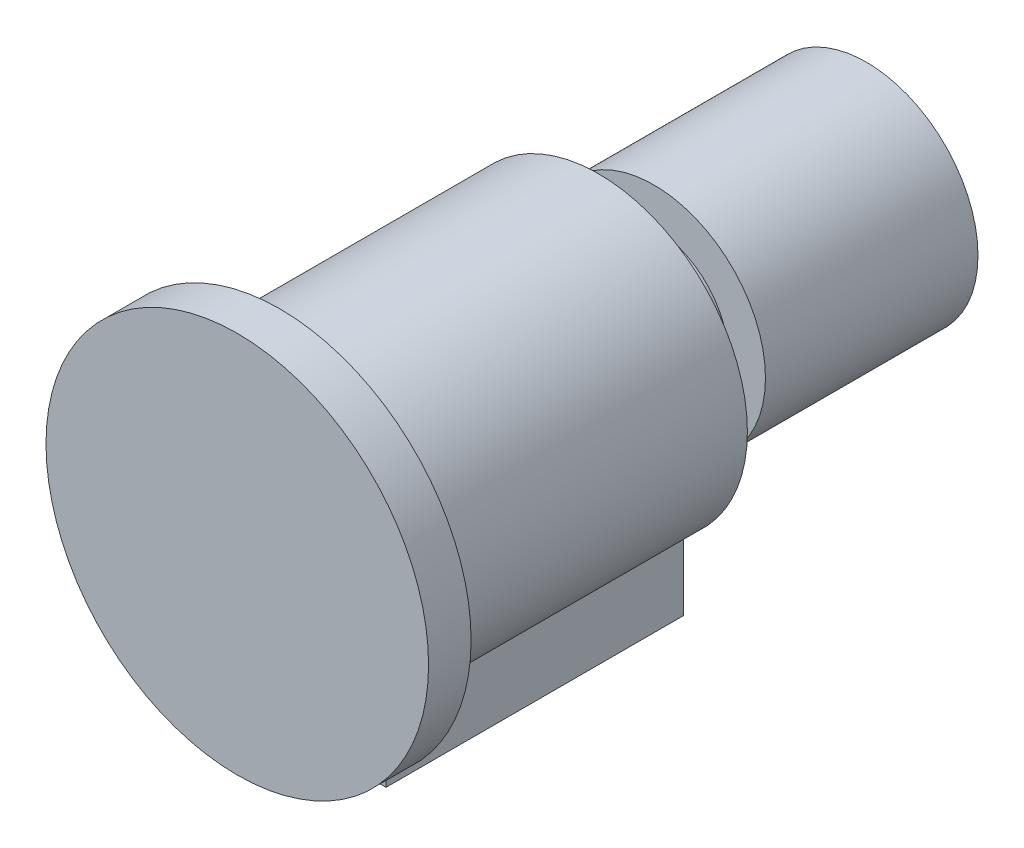
ISO-10303-21;
HEADER;
FILE_DESCRIPTION(('STEP AP214'),'2;1');
FILE_NAME('part.step','',(''),(''),'','','');
FILE_SCHEMA(('AUTOMOTIVE_DESIGN { 1 0 10303 214 1 1 1 1 }'));
ENDSEC;
DATA;
#1=APPLICATION_CONTEXT('core data for automotive mechanical design processes');
#2=APPLICATION_PROTOCOL_DEFINITION('international standard','automotive_design',2000,#1);
#3=PRODUCT_CONTEXT('',#1,'mechanical');
#4=PRODUCT('Part','Part','',(#3));
#5=PRODUCT_RELATED_PRODUCT_CATEGORY('part','',(#4));
#6=PRODUCT_DEFINITION_FORMATION('','',#4);
#7=PRODUCT_DEFINITION_CONTEXT('part definition',#1,'design');
#8=PRODUCT_DEFINITION('design','',#6,#7);
#9=PRODUCT_DEFINITION_SHAPE('','',#8);
#10=(LENGTH_UNIT() NAMED_UNIT(*) SI_UNIT(.MILLI.,.METRE.));
#11=(NAMED_UNIT(*) PLANE_ANGLE_UNIT() SI_UNIT($,.RADIAN.));
#12=(NAMED_UNIT(*) SI_UNIT($,.STERADIAN.) SOLID_ANGLE_UNIT());
#13=UNCERTAINTY_MEASURE_WITH_UNIT(LENGTH_MEASURE(1.E-05),#10,'distance_accuracy_value','');
#14=(GEOMETRIC_REPRESENTATION_CONTEXT(3) GLOBAL_UNCERTAINTY_ASSIGNED_CONTEXT((#13)) GLOBAL_UNIT_ASSIGNED_CONTEXT((#10,
#11,#12)) REPRESENTATION_CONTEXT('',''));
#15=CARTESIAN_POINT('',(0.,0.,0.));
#16=DIRECTION('',(0.,0.,1.));
#17=DIRECTION('',(1.,0.,0.));
#18=AXIS2_PLACEMENT_3D('',#15,#16,#17);
#19=CARTESIAN_POINT('',(0.,0.,-176.));
#20=DIRECTION('',(0.,0.,-1.));
#21=DIRECTION('',(-1.,0.,0.));
#22=AXIS2_PLACEMENT_3D('',#19,#20,#21);
#23=CYLINDRICAL_SURFACE('',#22,52.5);
#24=CARTESIAN_POINT('',(0.,0.,-176.));
#25=DIRECTION('',(0.,0.,1.));
#26=DIRECTION('',(1.,0.,0.));
#27=AXIS2_PLACEMENT_3D('',#24,#25,#26);
#28=CIRCLE('',#27,52.5);
#29=CARTESIAN_POINT('',(52.5,0.,-176.));
#30=VERTEX_POINT('',#29);
#31=EDGE_CURVE('E11',#30,#30,#28,.T.);
#32=ORIENTED_EDGE('',*,*,#31,.F.);
#33=EDGE_LOOP('',(#32));
#34=FACE_BOUND('',#33,.T.);
#35=CARTESIAN_POINT('',(0.,0.,-276.));
#36=DIRECTION('',(0.,0.,1.));
#37=DIRECTION('',(1.,0.,0.));
#38=AXIS2_PLACEMENT_3D('',#35,#36,#37);
#39=CIRCLE('',#38,52.5);
#40=CARTESIAN_POINT('',(52.5,0.,-276.));
#41=VERTEX_POINT('',#40);
#42=EDGE_CURVE('E47',#41,#41,#39,.T.);
#43=ORIENTED_EDGE('',*,*,#42,.T.);
#44=EDGE_LOOP('',(#43));
#45=FACE_BOUND('',#44,.T.);
#46=ADVANCED_FACE('F44',(#34,#45),#23,.T.);
#47=CARTESIAN_POINT('',(0.,0.,-176.));
#48=DIRECTION('',(0.,0.,1.));
#49=DIRECTION('',(1.,0.,0.));
#50=AXIS2_PLACEMENT_3D('',#47,#48,#49);
#51=PLANE('',#50);
#52=ORIENTED_EDGE('',*,*,#31,.T.);
#53=EDGE_LOOP('',(#52));
#54=FACE_BOUND('',#53,.T.);
#55=ADVANCED_FACE('F59',(#54),#51,.T.);
#56=CARTESIAN_POINT('',(0.,0.,-276.));
#57=DIRECTION('',(0.,0.,1.));
#58=DIRECTION('',(1.,0.,0.));
#59=AXIS2_PLACEMENT_3D('',#56,#57,#58);
#60=PLANE('',#59);
#61=ORIENTED_EDGE('',*,*,#42,.F.);
#62=EDGE_LOOP('',(#61));
#63=FACE_BOUND('',#62,.T.);
#64=ADVANCED_FACE('F57',(#63),#60,.F.);
#65=CLOSED_SHELL('',(#46,#55,#64));
#66=MANIFOLD_SOLID_BREP('B2',#65);
#67=CARTESIAN_POINT('',(0.,0.,-150.));
#68=DIRECTION('',(0.,0.,1.));
#69=DIRECTION('',(1.,0.,0.));
#70=AXIS2_PLACEMENT_3D('',#67,#68,#69);
#71=CYLINDRICAL_SURFACE('',#70,70.);
#72=CARTESIAN_POINT('',(0.,0.,-150.));
#73=DIRECTION('',(0.,0.,1.));
#74=DIRECTION('',(1.,0.,0.));
#75=AXIS2_PLACEMENT_3D('',#72,#73,#74);
#76=CIRCLE('',#75,70.);
#77=CARTESIAN_POINT('',(70.,0.,-150.));
#78=VERTEX_POINT('',#77);
#79=EDGE_CURVE('E155',#78,#78,#76,.T.);
#80=ORIENTED_EDGE('',*,*,#79,.T.);
#81=EDGE_LOOP('',(#80));
#82=FACE_BOUND('',#81,.T.);
#83=CARTESIAN_POINT('',(0.,0.,0.));
#84=DIRECTION('',(0.,0.,1.));
#85=DIRECTION('',(1.,0.,0.));
#86=AXIS2_PLACEMENT_3D('',#83,#84,#85);
#87=CIRCLE('',#86,70.);
#88=CARTESIAN_POINT('',(70.,0.,0.));
#89=VERTEX_POINT('',#88);
#90=EDGE_CURVE('E153',#89,#89,#87,.T.);
#91=ORIENTED_EDGE('',*,*,#90,.F.);
#92=EDGE_LOOP('',(#91));
#93=FACE_BOUND('',#92,.T.);
#94=CARTESIAN_POINT('',(0.,0.,-145.));
#95=DIRECTION('',(0.,0.,1.));
#96=DIRECTION('',(1.,0.,0.));
#97=AXIS2_PLACEMENT_3D('',#94,#95,#96);
#98=CIRCLE('',#97,70.);
#99=CARTESIAN_POINT('',(45.,-53.6190264738181,-145.));
#100=VERTEX_POINT('',#99);
#101=CARTESIAN_POINT('',(-45.,-53.6190264738181,-145.));
#102=VERTEX_POINT('',#101);
#103=EDGE_CURVE('E92',#100,#102,#98,.F.);
#104=ORIENTED_EDGE('',*,*,#103,.T.);
#105=DIRECTION('',(0.,0.,1.));
#106=VECTOR('',#105,1.);
#107=CARTESIAN_POINT('',(-45.,-53.6190264738181,-150.));
#108=LINE('',#107,#106);
#109=CARTESIAN_POINT('',(-45.,-53.6190264738181,-5.));
#110=VERTEX_POINT('',#109);
#111=EDGE_CURVE('E42',#102,#110,#108,.T.);
#112=ORIENTED_EDGE('',*,*,#111,.T.);
#113=CARTESIAN_POINT('',(0.,0.,-5.));
#114=DIRECTION('',(0.,0.,1.));
#115=DIRECTION('',(1.,0.,0.));
#116=AXIS2_PLACEMENT_3D('',#113,#114,#115);
#117=CIRCLE('',#116,70.);
#118=CARTESIAN_POINT('',(45.,-53.6190264738181,-5.));
#119=VERTEX_POINT('',#118);
#120=EDGE_CURVE('E164',#119,#110,#117,.F.);
#121=ORIENTED_EDGE('',*,*,#120,.F.);
#122=DIRECTION('',(0.,0.,1.));
#123=VECTOR('',#122,1.);
#124=CARTESIAN_POINT('',(45.,-53.6190264738181,-150.));
#125=LINE('',#124,#123);
#126=EDGE_CURVE('E102',#100,#119,#125,.T.);
#127=ORIENTED_EDGE('',*,*,#126,.F.);
#128=EDGE_LOOP('',(#104,#112,#121,#127));
#129=FACE_BOUND('',#128,.T.);
#130=ADVANCED_FACE('F84',(#82,#93,#129),#71,.T.);
#131=CARTESIAN_POINT('',(0.,0.,20.));
#132=DIRECTION('',(0.,0.,-1.));
#133=DIRECTION('',(-1.,0.,0.));
#134=AXIS2_PLACEMENT_3D('',#131,#132,#133);
#135=CYLINDRICAL_SURFACE('',#134,90.);
#136=CARTESIAN_POINT('',(0.,0.,20.));
#137=DIRECTION('',(0.,0.,1.));
#138=DIRECTION('',(1.,0.,0.));
#139=AXIS2_PLACEMENT_3D('',#136,#137,#138);
#140=CIRCLE('',#139,90.);
#141=CARTESIAN_POINT('',(90.,0.,20.));
#142=VERTEX_POINT('',#141);
#143=EDGE_CURVE('E161',#142,#142,#140,.T.);
#144=ORIENTED_EDGE('',*,*,#143,.F.);
#145=EDGE_LOOP('',(#144));
#146=FACE_BOUND('',#145,.T.);
#147=CARTESIAN_POINT('',(0.,0.,0.));
#148=DIRECTION('',(0.,0.,1.));
#149=DIRECTION('',(1.,0.,0.));
#150=AXIS2_PLACEMENT_3D('',#147,#148,#149);
#151=CIRCLE('',#150,90.);
#152=CARTESIAN_POINT('',(90.,0.,0.));
#153=VERTEX_POINT('',#152);
#154=EDGE_CURVE('E158',#153,#153,#151,.T.);
#155=ORIENTED_EDGE('',*,*,#154,.T.);
#156=EDGE_LOOP('',(#155));
#157=FACE_BOUND('',#156,.T.);
#158=ADVANCED_FACE('F86',(#146,#157),#135,.T.);
#159=CARTESIAN_POINT('',(0.,0.,20.));
#160=DIRECTION('',(0.,0.,1.));
#161=DIRECTION('',(1.,0.,0.));
#162=AXIS2_PLACEMENT_3D('',#159,#160,#161);
#163=PLANE('',#162);
#164=ORIENTED_EDGE('',*,*,#143,.T.);
#165=EDGE_LOOP('',(#164));
#166=FACE_BOUND('',#165,.T.);
#167=ADVANCED_FACE('F184',(#166),#163,.T.);
#168=CARTESIAN_POINT('',(0.,0.,0.));
#169=DIRECTION('',(0.,0.,1.));
#170=DIRECTION('',(1.,0.,0.));
#171=AXIS2_PLACEMENT_3D('',#168,#169,#170);
#172=PLANE('',#171);
#173=ORIENTED_EDGE('',*,*,#90,.T.);
#174=EDGE_LOOP('',(#173));
#175=FACE_BOUND('',#174,.T.);
#176=ORIENTED_EDGE('',*,*,#154,.F.);
#177=EDGE_LOOP('',(#176));
#178=FACE_BOUND('',#177,.T.);
#179=ADVANCED_FACE('F192',(#175,#178),#172,.F.);
#180=CARTESIAN_POINT('',(0.,0.,-150.));
#181=DIRECTION('',(0.,0.,1.));
#182=DIRECTION('',(1.,0.,0.));
#183=AXIS2_PLACEMENT_3D('',#180,#181,#182);
#184=PLANE('',#183);
#185=CARTESIAN_POINT('',(0.,0.,-150.));
#186=DIRECTION('',(0.,0.,1.));
#187=DIRECTION('',(1.,0.,0.));
#188=AXIS2_PLACEMENT_3D('',#185,#186,#187);
#189=CIRCLE('',#188,35.);
#190=CARTESIAN_POINT('',(35.,0.,-150.));
#191=VERTEX_POINT('',#190);
#192=EDGE_CURVE('E143',#191,#191,#189,.T.);
#193=ORIENTED_EDGE('',*,*,#192,.T.);
#194=EDGE_LOOP('',(#193));
#195=FACE_BOUND('',#194,.T.);
#196=ORIENTED_EDGE('',*,*,#79,.F.);
#197=EDGE_LOOP('',(#196));
#198=FACE_BOUND('',#197,.T.);
#199=ADVANCED_FACE('F189',(#195,#198),#184,.F.);
#200=CARTESIAN_POINT('',(0.,0.,-275.));
#201=DIRECTION('',(0.,0.,1.));
#202=DIRECTION('',(1.,0.,0.));
#203=AXIS2_PLACEMENT_3D('',#200,#201,#202);
#204=CYLINDRICAL_SURFACE('',#203,35.);
#205=CARTESIAN_POINT('',(0.,0.,-275.));
#206=DIRECTION('',(0.,0.,1.));
#207=DIRECTION('',(1.,0.,0.));
#208=AXIS2_PLACEMENT_3D('',#205,#206,#207);
#209=CIRCLE('',#208,35.);
#210=CARTESIAN_POINT('',(35.,0.,-275.));
#211=VERTEX_POINT('',#210);
#212=EDGE_CURVE('E146',#211,#211,#209,.T.);
#213=ORIENTED_EDGE('',*,*,#212,.T.);
#214=EDGE_LOOP('',(#213));
#215=FACE_BOUND('',#214,.T.);
#216=ORIENTED_EDGE('',*,*,#192,.F.);
#217=EDGE_LOOP('',(#216));
#218=FACE_BOUND('',#217,.T.);
#219=ADVANCED_FACE('F199',(#215,#218),#204,.T.);
#220=CARTESIAN_POINT('',(0.,0.,-275.));
#221=DIRECTION('',(0.,0.,1.));
#222=DIRECTION('',(1.,0.,0.));
#223=AXIS2_PLACEMENT_3D('',#220,#221,#222);
#224=PLANE('',#223);
#225=ORIENTED_EDGE('',*,*,#212,.F.);
#226=EDGE_LOOP('',(#225));
#227=FACE_BOUND('',#226,.T.);
#228=ADVANCED_FACE('F208',(#227),#224,.F.);
#229=CARTESIAN_POINT('',(-45.,-85.,-5.));
#230=DIRECTION('',(1.,0.,0.));
#231=DIRECTION('',(0.,0.,-1.));
#232=AXIS2_PLACEMENT_3D('',#229,#230,#231);
#233=PLANE('',#232);
#234=ORIENTED_EDGE('',*,*,#111,.F.);
#235=DIRECTION('',(0.,1.,0.));
#236=VECTOR('',#235,1.);
#237=CARTESIAN_POINT('',(-45.,-85.,-145.));
#238=LINE('',#237,#236);
#239=CARTESIAN_POINT('',(-45.,-85.,-145.));
#240=VERTEX_POINT('',#239);
#241=EDGE_CURVE('E125',#240,#102,#238,.T.);
#242=ORIENTED_EDGE('',*,*,#241,.F.);
#243=DIRECTION('',(0.,0.,-1.));
#244=VECTOR('',#243,1.);
#245=CARTESIAN_POINT('',(-45.,-85.,-5.));
#246=LINE('',#245,#244);
#247=CARTESIAN_POINT('',(-45.,-85.,-5.));
#248=VERTEX_POINT('',#247);
#249=EDGE_CURVE('E132',#248,#240,#246,.T.);
#250=ORIENTED_EDGE('',*,*,#249,.F.);
#251=DIRECTION('',(0.,1.,0.));
#252=VECTOR('',#251,1.);
#253=CARTESIAN_POINT('',(-45.,-85.,-5.));
#254=LINE('',#253,#252);
#255=EDGE_CURVE('E174',#248,#110,#254,.T.);
#256=ORIENTED_EDGE('',*,*,#255,.T.);
#257=EDGE_LOOP('',(#234,#242,#250,#256));
#258=FACE_BOUND('',#257,.T.);
#259=ADVANCED_FACE('F142',(#258),#233,.F.);
#260=CARTESIAN_POINT('',(-45.,-85.,-145.));
#261=DIRECTION('',(0.,0.,1.));
#262=DIRECTION('',(1.,0.,0.));
#263=AXIS2_PLACEMENT_3D('',#260,#261,#262);
#264=PLANE('',#263);
#265=ORIENTED_EDGE('',*,*,#103,.F.);
#266=DIRECTION('',(0.,1.,0.));
#267=VECTOR('',#266,1.);
#268=CARTESIAN_POINT('',(45.,-85.,-145.));
#269=LINE('',#268,#267);
#270=CARTESIAN_POINT('',(45.,-85.,-145.));
#271=VERTEX_POINT('',#270);
#272=EDGE_CURVE('E127',#271,#100,#269,.T.);
#273=ORIENTED_EDGE('',*,*,#272,.F.);
#274=DIRECTION('',(1.,0.,0.));
#275=VECTOR('',#274,1.);
#276=CARTESIAN_POINT('',(-45.,-85.,-145.));
#277=LINE('',#276,#275);
#278=EDGE_CURVE('E121',#240,#271,#277,.T.);
#279=ORIENTED_EDGE('',*,*,#278,.F.);
#280=ORIENTED_EDGE('',*,*,#241,.T.);
#281=EDGE_LOOP('',(#265,#273,#279,#280));
#282=FACE_BOUND('',#281,.T.);
#283=ADVANCED_FACE('F123',(#282),#264,.F.);
#284=CARTESIAN_POINT('',(45.,-85.,-5.));
#285=DIRECTION('',(1.,0.,0.));
#286=DIRECTION('',(0.,0.,-1.));
#287=AXIS2_PLACEMENT_3D('',#284,#285,#286);
#288=PLANE('',#287);
#289=ORIENTED_EDGE('',*,*,#272,.T.);
#290=ORIENTED_EDGE('',*,*,#126,.T.);
#291=DIRECTION('',(0.,1.,0.));
#292=VECTOR('',#291,1.);
#293=CARTESIAN_POINT('',(45.,-85.,-5.));
#294=LINE('',#293,#292);
#295=CARTESIAN_POINT('',(45.,-85.,-5.));
#296=VERTEX_POINT('',#295);
#297=EDGE_CURVE('E148',#296,#119,#294,.T.);
#298=ORIENTED_EDGE('',*,*,#297,.F.);
#299=DIRECTION('',(0.,0.,-1.));
#300=VECTOR('',#299,1.);
#301=CARTESIAN_POINT('',(45.,-85.,-5.));
#302=LINE('',#301,#300);
#303=EDGE_CURVE('E131',#296,#271,#302,.T.);
#304=ORIENTED_EDGE('',*,*,#303,.T.);
#305=EDGE_LOOP('',(#289,#290,#298,#304));
#306=FACE_BOUND('',#305,.T.);
#307=ADVANCED_FACE('F171',(#306),#288,.T.);
#308=CARTESIAN_POINT('',(-45.,-85.,-5.));
#309=DIRECTION('',(0.,0.,1.));
#310=DIRECTION('',(1.,0.,0.));
#311=AXIS2_PLACEMENT_3D('',#308,#309,#310);
#312=PLANE('',#311);
#313=ORIENTED_EDGE('',*,*,#297,.T.);
#314=ORIENTED_EDGE('',*,*,#120,.T.);
#315=ORIENTED_EDGE('',*,*,#255,.F.);
#316=DIRECTION('',(1.,0.,0.));
#317=VECTOR('',#316,1.);
#318=CARTESIAN_POINT('',(-45.,-85.,-5.));
#319=LINE('',#318,#317);
#320=EDGE_CURVE('E138',#248,#296,#319,.T.);
#321=ORIENTED_EDGE('',*,*,#320,.T.);
#322=EDGE_LOOP('',(#313,#314,#315,#321));
#323=FACE_BOUND('',#322,.T.);
#324=ADVANCED_FACE('F173',(#323),#312,.T.);
#325=CARTESIAN_POINT('',(0.,-85.,0.));
#326=DIRECTION('',(0.,-1.,0.));
#327=DIRECTION('',(0.,0.,-1.));
#328=AXIS2_PLACEMENT_3D('',#325,#326,#327);
#329=PLANE('',#328);
#330=ORIENTED_EDGE('',*,*,#249,.T.);
#331=ORIENTED_EDGE('',*,*,#278,.T.);
#332=ORIENTED_EDGE('',*,*,#303,.F.);
#333=ORIENTED_EDGE('',*,*,#320,.F.);
#334=EDGE_LOOP('',(#330,#331,#332,#333));
#335=FACE_BOUND('',#334,.T.);
#336=ADVANCED_FACE('F136',(#335),#329,.T.);
#337=CLOSED_SHELL('',(#130,#158,#167,#179,#199,#219,#228,#259,#283,#307,#324,#336));
#338=MANIFOLD_SOLID_BREP('B6',#337);
#339=ADVANCED_BREP_SHAPE_REPRESENTATION('',(#18,#66,#338),#14);
#340=SHAPE_DEFINITION_REPRESENTATION(#9,#339);
ENDSEC;
END-ISO-10303-21;
